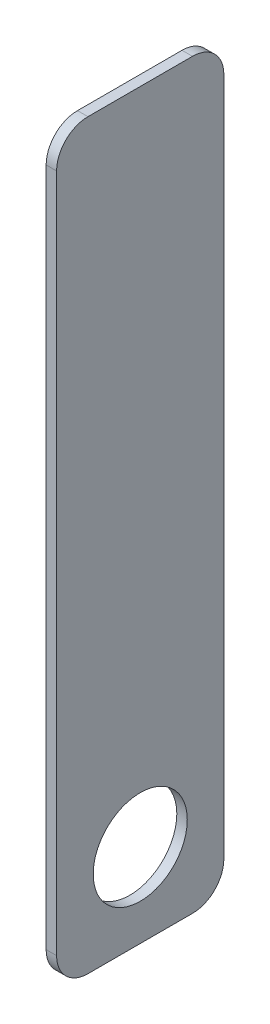
ISO-10303-21;
HEADER;
FILE_DESCRIPTION(('STEP AP214'),'2;1');
FILE_NAME('part.step','',(''),(''),'','','');
FILE_SCHEMA(('AUTOMOTIVE_DESIGN { 1 0 10303 214 1 1 1 1 }'));
ENDSEC;
DATA;
#1=APPLICATION_CONTEXT('core data for automotive mechanical design processes');
#2=APPLICATION_PROTOCOL_DEFINITION('international standard','automotive_design',2000,#1);
#3=PRODUCT_CONTEXT('',#1,'mechanical');
#4=PRODUCT('Part','Part','',(#3));
#5=PRODUCT_RELATED_PRODUCT_CATEGORY('part','',(#4));
#6=PRODUCT_DEFINITION_FORMATION('','',#4);
#7=PRODUCT_DEFINITION_CONTEXT('part definition',#1,'design');
#8=PRODUCT_DEFINITION('design','',#6,#7);
#9=PRODUCT_DEFINITION_SHAPE('','',#8);
#10=(LENGTH_UNIT() NAMED_UNIT(*) SI_UNIT(.MILLI.,.METRE.));
#11=(NAMED_UNIT(*) PLANE_ANGLE_UNIT() SI_UNIT($,.RADIAN.));
#12=(NAMED_UNIT(*) SI_UNIT($,.STERADIAN.) SOLID_ANGLE_UNIT());
#13=UNCERTAINTY_MEASURE_WITH_UNIT(LENGTH_MEASURE(1.E-05),#10,'distance_accuracy_value','');
#14=(GEOMETRIC_REPRESENTATION_CONTEXT(3) GLOBAL_UNCERTAINTY_ASSIGNED_CONTEXT((#13)) GLOBAL_UNIT_ASSIGNED_CONTEXT((#10,
#11,#12)) REPRESENTATION_CONTEXT('',''));
#15=CARTESIAN_POINT('',(0.,0.,0.));
#16=DIRECTION('',(0.,0.,1.));
#17=DIRECTION('',(1.,0.,0.));
#18=AXIS2_PLACEMENT_3D('',#15,#16,#17);
#19=CARTESIAN_POINT('',(3.175,0.,0.));
#20=DIRECTION('',(1.,0.,0.));
#21=DIRECTION('',(0.,0.,-1.));
#22=AXIS2_PLACEMENT_3D('',#19,#20,#21);
#23=PLANE('',#22);
#24=DIRECTION('',(0.,0.,-1.));
#25=VECTOR('',#24,1.);
#26=CARTESIAN_POINT('',(3.175,-112.7125,25.4));
#27=LINE('',#26,#25);
#28=CARTESIAN_POINT('',(3.175,-112.7125,15.875));
#29=VERTEX_POINT('',#28);
#30=CARTESIAN_POINT('',(3.175,-112.7125,-15.875));
#31=VERTEX_POINT('',#30);
#32=EDGE_CURVE('E167',#29,#31,#27,.T.);
#33=ORIENTED_EDGE('',*,*,#32,.T.);
#34=CARTESIAN_POINT('',(3.175,-103.1875,-15.875));
#35=DIRECTION('',(1.,0.,0.));
#36=DIRECTION('',(0.,0.,-1.));
#37=AXIS2_PLACEMENT_3D('',#34,#35,#36);
#38=CIRCLE('',#37,9.525);
#39=CARTESIAN_POINT('',(3.175,-103.1875,-25.4));
#40=VERTEX_POINT('',#39);
#41=EDGE_CURVE('E147',#31,#40,#38,.T.);
#42=ORIENTED_EDGE('',*,*,#41,.T.);
#43=DIRECTION('',(0.,1.,0.));
#44=VECTOR('',#43,1.);
#45=CARTESIAN_POINT('',(3.175,112.7125,-25.4));
#46=LINE('',#45,#44);
#47=CARTESIAN_POINT('',(3.175,103.1875,-25.4));
#48=VERTEX_POINT('',#47);
#49=EDGE_CURVE('E117',#40,#48,#46,.T.);
#50=ORIENTED_EDGE('',*,*,#49,.T.);
#51=CARTESIAN_POINT('',(3.175,103.1875,-15.875));
#52=DIRECTION('',(1.,0.,0.));
#53=DIRECTION('',(0.,0.,-1.));
#54=AXIS2_PLACEMENT_3D('',#51,#52,#53);
#55=CIRCLE('',#54,9.525);
#56=CARTESIAN_POINT('',(3.175,112.7125,-15.875));
#57=VERTEX_POINT('',#56);
#58=EDGE_CURVE('E53',#48,#57,#55,.T.);
#59=ORIENTED_EDGE('',*,*,#58,.T.);
#60=DIRECTION('',(0.,0.,1.));
#61=VECTOR('',#60,1.);
#62=CARTESIAN_POINT('',(3.175,112.7125,25.4));
#63=LINE('',#62,#61);
#64=CARTESIAN_POINT('',(3.175,112.7125,15.875));
#65=VERTEX_POINT('',#64);
#66=EDGE_CURVE('E134',#57,#65,#63,.T.);
#67=ORIENTED_EDGE('',*,*,#66,.T.);
#68=CARTESIAN_POINT('',(3.175,103.1875,15.875));
#69=DIRECTION('',(1.,0.,0.));
#70=DIRECTION('',(0.,0.,-1.));
#71=AXIS2_PLACEMENT_3D('',#68,#69,#70);
#72=CIRCLE('',#71,9.525);
#73=CARTESIAN_POINT('',(3.175,103.1875,25.4));
#74=VERTEX_POINT('',#73);
#75=EDGE_CURVE('E142',#65,#74,#72,.T.);
#76=ORIENTED_EDGE('',*,*,#75,.T.);
#77=DIRECTION('',(0.,-1.,0.));
#78=VECTOR('',#77,1.);
#79=CARTESIAN_POINT('',(3.175,112.7125,25.4));
#80=LINE('',#79,#78);
#81=CARTESIAN_POINT('',(3.175,-103.1875,25.4));
#82=VERTEX_POINT('',#81);
#83=EDGE_CURVE('E128',#74,#82,#80,.T.);
#84=ORIENTED_EDGE('',*,*,#83,.T.);
#85=CARTESIAN_POINT('',(3.175,-103.1875,15.875));
#86=DIRECTION('',(1.,0.,0.));
#87=DIRECTION('',(0.,0.,-1.));
#88=AXIS2_PLACEMENT_3D('',#85,#86,#87);
#89=CIRCLE('',#88,9.525);
#90=EDGE_CURVE('E145',#82,#29,#89,.T.);
#91=ORIENTED_EDGE('',*,*,#90,.T.);
#92=EDGE_LOOP('',(#33,#42,#50,#59,#67,#76,#84,#91));
#93=FACE_BOUND('',#92,.T.);
#94=CARTESIAN_POINT('',(3.175,-87.3125,0.));
#95=DIRECTION('',(1.,0.,0.));
#96=DIRECTION('',(0.,0.,-1.));
#97=AXIS2_PLACEMENT_3D('',#94,#95,#96);
#98=CIRCLE('',#97,14.2875);
#99=CARTESIAN_POINT('',(3.175,-87.3125,-14.2875));
#100=VERTEX_POINT('',#99);
#101=EDGE_CURVE('E173',#100,#100,#98,.T.);
#102=ORIENTED_EDGE('',*,*,#101,.F.);
#103=EDGE_LOOP('',(#102));
#104=FACE_BOUND('',#103,.T.);
#105=ADVANCED_FACE('F32',(#93,#104),#23,.T.);
#106=CARTESIAN_POINT('',(0.,0.,0.));
#107=DIRECTION('',(1.,0.,0.));
#108=DIRECTION('',(0.,0.,-1.));
#109=AXIS2_PLACEMENT_3D('',#106,#107,#108);
#110=PLANE('',#109);
#111=DIRECTION('',(0.,1.,0.));
#112=VECTOR('',#111,1.);
#113=CARTESIAN_POINT('',(0.,112.7125,-25.4));
#114=LINE('',#113,#112);
#115=CARTESIAN_POINT('',(0.,-103.1875,-25.4));
#116=VERTEX_POINT('',#115);
#117=CARTESIAN_POINT('',(0.,103.1875,-25.4));
#118=VERTEX_POINT('',#117);
#119=EDGE_CURVE('E115',#116,#118,#114,.T.);
#120=ORIENTED_EDGE('',*,*,#119,.F.);
#121=CARTESIAN_POINT('',(0.,-103.1875,-15.875));
#122=DIRECTION('',(1.,0.,0.));
#123=DIRECTION('',(0.,0.,-1.));
#124=AXIS2_PLACEMENT_3D('',#121,#122,#123);
#125=CIRCLE('',#124,9.525);
#126=CARTESIAN_POINT('',(0.,-112.7125,-15.875));
#127=VERTEX_POINT('',#126);
#128=EDGE_CURVE('E98',#116,#127,#125,.F.);
#129=ORIENTED_EDGE('',*,*,#128,.T.);
#130=DIRECTION('',(0.,0.,-1.));
#131=VECTOR('',#130,1.);
#132=CARTESIAN_POINT('',(0.,-112.7125,25.4));
#133=LINE('',#132,#131);
#134=CARTESIAN_POINT('',(0.,-112.7125,15.875));
#135=VERTEX_POINT('',#134);
#136=EDGE_CURVE('E126',#135,#127,#133,.T.);
#137=ORIENTED_EDGE('',*,*,#136,.F.);
#138=CARTESIAN_POINT('',(0.,-103.1875,15.875));
#139=DIRECTION('',(1.,0.,0.));
#140=DIRECTION('',(0.,0.,-1.));
#141=AXIS2_PLACEMENT_3D('',#138,#139,#140);
#142=CIRCLE('',#141,9.525);
#143=CARTESIAN_POINT('',(0.,-103.1875,25.4));
#144=VERTEX_POINT('',#143);
#145=EDGE_CURVE('E109',#135,#144,#142,.F.);
#146=ORIENTED_EDGE('',*,*,#145,.T.);
#147=DIRECTION('',(0.,-1.,0.));
#148=VECTOR('',#147,1.);
#149=CARTESIAN_POINT('',(0.,112.7125,25.4));
#150=LINE('',#149,#148);
#151=CARTESIAN_POINT('',(0.,103.1875,25.4));
#152=VERTEX_POINT('',#151);
#153=EDGE_CURVE('E130',#152,#144,#150,.T.);
#154=ORIENTED_EDGE('',*,*,#153,.F.);
#155=CARTESIAN_POINT('',(0.,103.1875,15.875));
#156=DIRECTION('',(1.,0.,0.));
#157=DIRECTION('',(0.,0.,-1.));
#158=AXIS2_PLACEMENT_3D('',#155,#156,#157);
#159=CIRCLE('',#158,9.525);
#160=CARTESIAN_POINT('',(0.,112.7125,15.875));
#161=VERTEX_POINT('',#160);
#162=EDGE_CURVE('E118',#152,#161,#159,.F.);
#163=ORIENTED_EDGE('',*,*,#162,.T.);
#164=DIRECTION('',(0.,0.,1.));
#165=VECTOR('',#164,1.);
#166=CARTESIAN_POINT('',(0.,112.7125,25.4));
#167=LINE('',#166,#165);
#168=CARTESIAN_POINT('',(0.,112.7125,-15.875));
#169=VERTEX_POINT('',#168);
#170=EDGE_CURVE('E125',#169,#161,#167,.T.);
#171=ORIENTED_EDGE('',*,*,#170,.F.);
#172=CARTESIAN_POINT('',(0.,103.1875,-15.875));
#173=DIRECTION('',(1.,0.,0.));
#174=DIRECTION('',(0.,0.,-1.));
#175=AXIS2_PLACEMENT_3D('',#172,#173,#174);
#176=CIRCLE('',#175,9.525);
#177=EDGE_CURVE('E124',#169,#118,#176,.F.);
#178=ORIENTED_EDGE('',*,*,#177,.T.);
#179=EDGE_LOOP('',(#120,#129,#137,#146,#154,#163,#171,#178));
#180=FACE_BOUND('',#179,.T.);
#181=CARTESIAN_POINT('',(0.,-87.3125,0.));
#182=DIRECTION('',(1.,0.,0.));
#183=DIRECTION('',(0.,0.,-1.));
#184=AXIS2_PLACEMENT_3D('',#181,#182,#183);
#185=CIRCLE('',#184,14.2875);
#186=CARTESIAN_POINT('',(0.,-87.3125,-14.2875));
#187=VERTEX_POINT('',#186);
#188=EDGE_CURVE('E175',#187,#187,#185,.T.);
#189=ORIENTED_EDGE('',*,*,#188,.T.);
#190=EDGE_LOOP('',(#189));
#191=FACE_BOUND('',#190,.T.);
#192=ADVANCED_FACE('F121',(#180,#191),#110,.F.);
#193=CARTESIAN_POINT('',(3.175,112.7125,25.4));
#194=DIRECTION('',(0.,0.,-1.));
#195=DIRECTION('',(-1.,0.,0.));
#196=AXIS2_PLACEMENT_3D('',#193,#194,#195);
#197=PLANE('',#196);
#198=ORIENTED_EDGE('',*,*,#153,.T.);
#199=DIRECTION('',(-1.,0.,0.));
#200=VECTOR('',#199,1.);
#201=CARTESIAN_POINT('',(3.175,-103.1875,25.4));
#202=LINE('',#201,#200);
#203=EDGE_CURVE('E152',#144,#82,#202,.F.);
#204=ORIENTED_EDGE('',*,*,#203,.T.);
#205=ORIENTED_EDGE('',*,*,#83,.F.);
#206=DIRECTION('',(-1.,0.,0.));
#207=VECTOR('',#206,1.);
#208=CARTESIAN_POINT('',(3.175,103.1875,25.4));
#209=LINE('',#208,#207);
#210=EDGE_CURVE('E149',#74,#152,#209,.T.);
#211=ORIENTED_EDGE('',*,*,#210,.T.);
#212=EDGE_LOOP('',(#198,#204,#205,#211));
#213=FACE_BOUND('',#212,.T.);
#214=ADVANCED_FACE('F158',(#213),#197,.F.);
#215=CARTESIAN_POINT('',(3.175,-112.7125,25.4));
#216=DIRECTION('',(0.,1.,0.));
#217=DIRECTION('',(0.,0.,1.));
#218=AXIS2_PLACEMENT_3D('',#215,#216,#217);
#219=PLANE('',#218);
#220=ORIENTED_EDGE('',*,*,#136,.T.);
#221=DIRECTION('',(-1.,0.,0.));
#222=VECTOR('',#221,1.);
#223=CARTESIAN_POINT('',(3.175,-112.7125,-15.875));
#224=LINE('',#223,#222);
#225=EDGE_CURVE('E103',#127,#31,#224,.F.);
#226=ORIENTED_EDGE('',*,*,#225,.T.);
#227=ORIENTED_EDGE('',*,*,#32,.F.);
#228=DIRECTION('',(-1.,0.,0.));
#229=VECTOR('',#228,1.);
#230=CARTESIAN_POINT('',(3.175,-112.7125,15.875));
#231=LINE('',#230,#229);
#232=EDGE_CURVE('E108',#29,#135,#231,.T.);
#233=ORIENTED_EDGE('',*,*,#232,.T.);
#234=EDGE_LOOP('',(#220,#226,#227,#233));
#235=FACE_BOUND('',#234,.T.);
#236=ADVANCED_FACE('F172',(#235),#219,.F.);
#237=CARTESIAN_POINT('',(3.175,112.7125,-25.4));
#238=DIRECTION('',(0.,0.,1.));
#239=DIRECTION('',(1.,0.,0.));
#240=AXIS2_PLACEMENT_3D('',#237,#238,#239);
#241=PLANE('',#240);
#242=ORIENTED_EDGE('',*,*,#49,.F.);
#243=DIRECTION('',(-1.,0.,0.));
#244=VECTOR('',#243,1.);
#245=CARTESIAN_POINT('',(3.175,-103.1875,-25.4));
#246=LINE('',#245,#244);
#247=EDGE_CURVE('E102',#40,#116,#246,.T.);
#248=ORIENTED_EDGE('',*,*,#247,.T.);
#249=ORIENTED_EDGE('',*,*,#119,.T.);
#250=DIRECTION('',(-1.,0.,0.));
#251=VECTOR('',#250,1.);
#252=CARTESIAN_POINT('',(3.175,103.1875,-25.4));
#253=LINE('',#252,#251);
#254=EDGE_CURVE('E119',#118,#48,#253,.F.);
#255=ORIENTED_EDGE('',*,*,#254,.T.);
#256=EDGE_LOOP('',(#242,#248,#249,#255));
#257=FACE_BOUND('',#256,.T.);
#258=ADVANCED_FACE('F114',(#257),#241,.F.);
#259=CARTESIAN_POINT('',(3.175,112.7125,25.4));
#260=DIRECTION('',(0.,-1.,0.));
#261=DIRECTION('',(0.,0.,-1.));
#262=AXIS2_PLACEMENT_3D('',#259,#260,#261);
#263=PLANE('',#262);
#264=ORIENTED_EDGE('',*,*,#66,.F.);
#265=DIRECTION('',(-1.,0.,0.));
#266=VECTOR('',#265,1.);
#267=CARTESIAN_POINT('',(3.175,112.7125,-15.875));
#268=LINE('',#267,#266);
#269=EDGE_CURVE('E11',#57,#169,#268,.T.);
#270=ORIENTED_EDGE('',*,*,#269,.T.);
#271=ORIENTED_EDGE('',*,*,#170,.T.);
#272=DIRECTION('',(-1.,0.,0.));
#273=VECTOR('',#272,1.);
#274=CARTESIAN_POINT('',(3.175,112.7125,15.875));
#275=LINE('',#274,#273);
#276=EDGE_CURVE('E40',#161,#65,#275,.F.);
#277=ORIENTED_EDGE('',*,*,#276,.T.);
#278=EDGE_LOOP('',(#264,#270,#271,#277));
#279=FACE_BOUND('',#278,.T.);
#280=ADVANCED_FACE('F186',(#279),#263,.F.);
#281=CARTESIAN_POINT('',(3.175,-87.3125,0.));
#282=DIRECTION('',(-1.,0.,0.));
#283=DIRECTION('',(0.,0.,1.));
#284=AXIS2_PLACEMENT_3D('',#281,#282,#283);
#285=CYLINDRICAL_SURFACE('',#284,14.2875);
#286=ORIENTED_EDGE('',*,*,#101,.T.);
#287=EDGE_LOOP('',(#286));
#288=FACE_BOUND('',#287,.T.);
#289=ORIENTED_EDGE('',*,*,#188,.F.);
#290=EDGE_LOOP('',(#289));
#291=FACE_BOUND('',#290,.T.);
#292=ADVANCED_FACE('F184',(#288,#291),#285,.F.);
#293=CARTESIAN_POINT('',(3.175,-103.1875,-15.875));
#294=DIRECTION('',(-1.,0.,0.));
#295=DIRECTION('',(0.,0.,1.));
#296=AXIS2_PLACEMENT_3D('',#293,#294,#295);
#297=CYLINDRICAL_SURFACE('',#296,9.525);
#298=ORIENTED_EDGE('',*,*,#41,.F.);
#299=ORIENTED_EDGE('',*,*,#225,.F.);
#300=ORIENTED_EDGE('',*,*,#128,.F.);
#301=ORIENTED_EDGE('',*,*,#247,.F.);
#302=EDGE_LOOP('',(#298,#299,#300,#301));
#303=FACE_BOUND('',#302,.T.);
#304=ADVANCED_FACE('F101',(#303),#297,.T.);
#305=CARTESIAN_POINT('',(3.175,-103.1875,15.875));
#306=DIRECTION('',(-1.,0.,0.));
#307=DIRECTION('',(0.,0.,1.));
#308=AXIS2_PLACEMENT_3D('',#305,#306,#307);
#309=CYLINDRICAL_SURFACE('',#308,9.525);
#310=ORIENTED_EDGE('',*,*,#90,.F.);
#311=ORIENTED_EDGE('',*,*,#203,.F.);
#312=ORIENTED_EDGE('',*,*,#145,.F.);
#313=ORIENTED_EDGE('',*,*,#232,.F.);
#314=EDGE_LOOP('',(#310,#311,#312,#313));
#315=FACE_BOUND('',#314,.T.);
#316=ADVANCED_FACE('F170',(#315),#309,.T.);
#317=CARTESIAN_POINT('',(3.175,103.1875,-15.875));
#318=DIRECTION('',(-1.,0.,0.));
#319=DIRECTION('',(0.,0.,1.));
#320=AXIS2_PLACEMENT_3D('',#317,#318,#319);
#321=CYLINDRICAL_SURFACE('',#320,9.525);
#322=ORIENTED_EDGE('',*,*,#58,.F.);
#323=ORIENTED_EDGE('',*,*,#254,.F.);
#324=ORIENTED_EDGE('',*,*,#177,.F.);
#325=ORIENTED_EDGE('',*,*,#269,.F.);
#326=EDGE_LOOP('',(#322,#323,#324,#325));
#327=FACE_BOUND('',#326,.T.);
#328=ADVANCED_FACE('F209',(#327),#321,.T.);
#329=CARTESIAN_POINT('',(3.175,103.1875,15.875));
#330=DIRECTION('',(-1.,0.,0.));
#331=DIRECTION('',(0.,0.,1.));
#332=AXIS2_PLACEMENT_3D('',#329,#330,#331);
#333=CYLINDRICAL_SURFACE('',#332,9.525);
#334=ORIENTED_EDGE('',*,*,#75,.F.);
#335=ORIENTED_EDGE('',*,*,#276,.F.);
#336=ORIENTED_EDGE('',*,*,#162,.F.);
#337=ORIENTED_EDGE('',*,*,#210,.F.);
#338=EDGE_LOOP('',(#334,#335,#336,#337));
#339=FACE_BOUND('',#338,.T.);
#340=ADVANCED_FACE('F34',(#339),#333,.T.);
#341=CLOSED_SHELL('',(#105,#192,#214,#236,#258,#280,#292,#304,#316,#328,#340));
#342=MANIFOLD_SOLID_BREP('B2',#341);
#343=ADVANCED_BREP_SHAPE_REPRESENTATION('',(#18,#342),#14);
#344=SHAPE_DEFINITION_REPRESENTATION(#9,#343);
ENDSEC;
END-ISO-10303-21;
